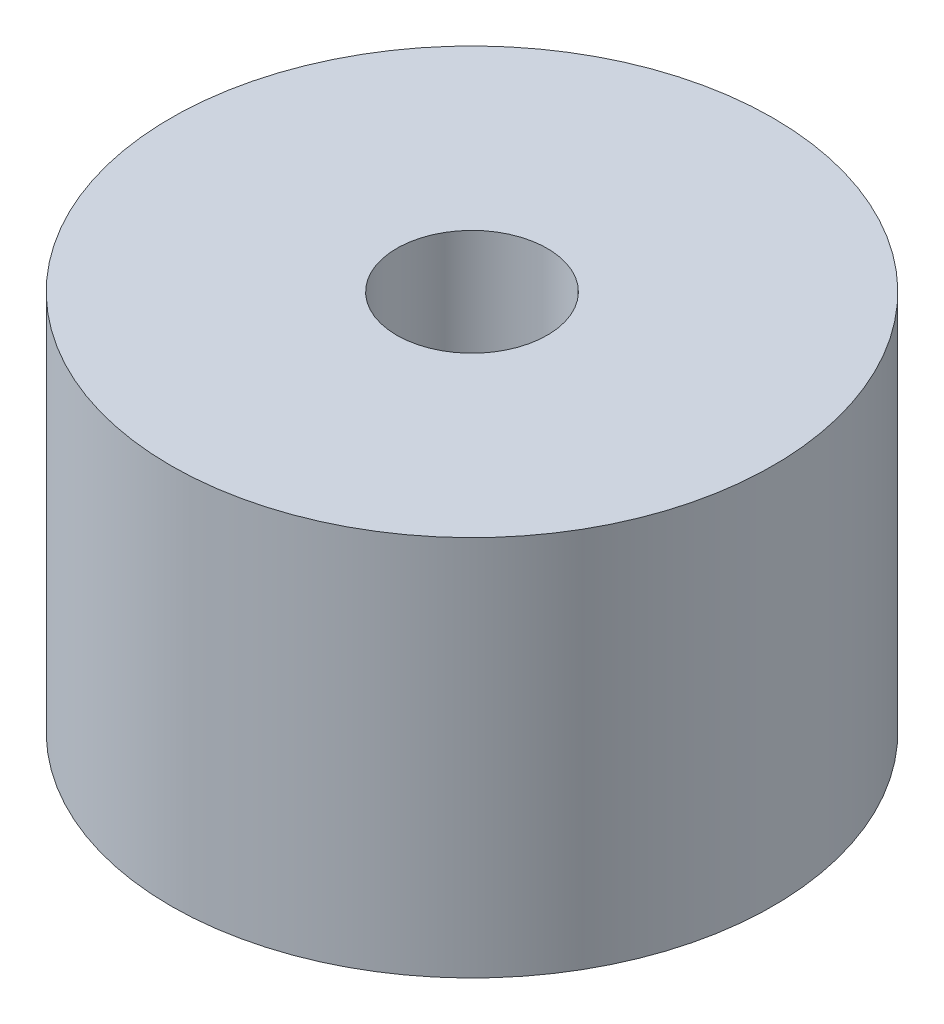
ISO-10303-21;
HEADER;
FILE_DESCRIPTION(('STEP AP214'),'2;1');
FILE_NAME('part.step','',(''),(''),'','','');
FILE_SCHEMA(('AUTOMOTIVE_DESIGN { 1 0 10303 214 1 1 1 1 }'));
ENDSEC;
DATA;
#1=APPLICATION_CONTEXT('core data for automotive mechanical design processes');
#2=APPLICATION_PROTOCOL_DEFINITION('international standard','automotive_design',2000,#1);
#3=PRODUCT_CONTEXT('',#1,'mechanical');
#4=PRODUCT('Part','Part','',(#3));
#5=PRODUCT_RELATED_PRODUCT_CATEGORY('part','',(#4));
#6=PRODUCT_DEFINITION_FORMATION('','',#4);
#7=PRODUCT_DEFINITION_CONTEXT('part definition',#1,'design');
#8=PRODUCT_DEFINITION('design','',#6,#7);
#9=PRODUCT_DEFINITION_SHAPE('','',#8);
#10=(LENGTH_UNIT() NAMED_UNIT(*) SI_UNIT(.MILLI.,.METRE.));
#11=(NAMED_UNIT(*) PLANE_ANGLE_UNIT() SI_UNIT($,.RADIAN.));
#12=(NAMED_UNIT(*) SI_UNIT($,.STERADIAN.) SOLID_ANGLE_UNIT());
#13=UNCERTAINTY_MEASURE_WITH_UNIT(LENGTH_MEASURE(1.E-05),#10,'distance_accuracy_value','');
#14=(GEOMETRIC_REPRESENTATION_CONTEXT(3) GLOBAL_UNCERTAINTY_ASSIGNED_CONTEXT((#13)) GLOBAL_UNIT_ASSIGNED_CONTEXT((#10,
#11,#12)) REPRESENTATION_CONTEXT('',''));
#15=CARTESIAN_POINT('',(0.,0.,0.));
#16=DIRECTION('',(0.,0.,1.));
#17=DIRECTION('',(1.,0.,0.));
#18=AXIS2_PLACEMENT_3D('',#15,#16,#17);
#19=CARTESIAN_POINT('',(0.,7.6,0.));
#20=DIRECTION('',(0.,-1.,0.));
#21=DIRECTION('',(0.,0.,-1.));
#22=AXIS2_PLACEMENT_3D('',#19,#20,#21);
#23=CYLINDRICAL_SURFACE('',#22,6.);
#24=CARTESIAN_POINT('',(0.,7.6,0.));
#25=DIRECTION('',(0.,1.,0.));
#26=DIRECTION('',(0.,0.,1.));
#27=AXIS2_PLACEMENT_3D('',#24,#25,#26);
#28=CIRCLE('',#27,6.);
#29=CARTESIAN_POINT('',(0.,7.6,6.));
#30=VERTEX_POINT('',#29);
#31=EDGE_CURVE('E10',#30,#30,#28,.T.);
#32=ORIENTED_EDGE('',*,*,#31,.F.);
#33=EDGE_LOOP('',(#32));
#34=FACE_BOUND('',#33,.T.);
#35=CARTESIAN_POINT('',(0.,0.,0.));
#36=DIRECTION('',(0.,1.,0.));
#37=DIRECTION('',(0.,0.,1.));
#38=AXIS2_PLACEMENT_3D('',#35,#36,#37);
#39=CIRCLE('',#38,6.);
#40=CARTESIAN_POINT('',(0.,0.,6.));
#41=VERTEX_POINT('',#40);
#42=EDGE_CURVE('E34',#41,#41,#39,.T.);
#43=ORIENTED_EDGE('',*,*,#42,.T.);
#44=EDGE_LOOP('',(#43));
#45=FACE_BOUND('',#44,.T.);
#46=ADVANCED_FACE('F31',(#34,#45),#23,.T.);
#47=CARTESIAN_POINT('',(0.,7.6,0.));
#48=DIRECTION('',(0.,1.,0.));
#49=DIRECTION('',(0.,0.,1.));
#50=AXIS2_PLACEMENT_3D('',#47,#48,#49);
#51=PLANE('',#50);
#52=CARTESIAN_POINT('',(0.,7.6,0.));
#53=DIRECTION('',(0.,1.,0.));
#54=DIRECTION('',(0.,0.,1.));
#55=AXIS2_PLACEMENT_3D('',#52,#53,#54);
#56=CIRCLE('',#55,1.5);
#57=CARTESIAN_POINT('',(0.,7.6,1.5));
#58=VERTEX_POINT('',#57);
#59=EDGE_CURVE('E43',#58,#58,#56,.T.);
#60=ORIENTED_EDGE('',*,*,#59,.F.);
#61=EDGE_LOOP('',(#60));
#62=FACE_BOUND('',#61,.T.);
#63=ORIENTED_EDGE('',*,*,#31,.T.);
#64=EDGE_LOOP('',(#63));
#65=FACE_BOUND('',#64,.T.);
#66=ADVANCED_FACE('F58',(#62,#65),#51,.T.);
#67=CARTESIAN_POINT('',(0.,0.,0.));
#68=DIRECTION('',(0.,1.,0.));
#69=DIRECTION('',(0.,0.,1.));
#70=AXIS2_PLACEMENT_3D('',#67,#68,#69);
#71=PLANE('',#70);
#72=ORIENTED_EDGE('',*,*,#42,.F.);
#73=EDGE_LOOP('',(#72));
#74=FACE_BOUND('',#73,.T.);
#75=ADVANCED_FACE('F54',(#74),#71,.F.);
#76=CARTESIAN_POINT('',(0.,3.6,0.));
#77=DIRECTION('',(0.,1.,0.));
#78=DIRECTION('',(0.,0.,1.));
#79=AXIS2_PLACEMENT_3D('',#76,#77,#78);
#80=CYLINDRICAL_SURFACE('',#79,1.5);
#81=CARTESIAN_POINT('',(0.,3.6,0.));
#82=DIRECTION('',(0.,1.,0.));
#83=DIRECTION('',(0.,0.,1.));
#84=AXIS2_PLACEMENT_3D('',#81,#82,#83);
#85=CIRCLE('',#84,1.5);
#86=CARTESIAN_POINT('',(0.,3.6,1.5));
#87=VERTEX_POINT('',#86);
#88=EDGE_CURVE('E41',#87,#87,#85,.T.);
#89=ORIENTED_EDGE('',*,*,#88,.F.);
#90=EDGE_LOOP('',(#89));
#91=FACE_BOUND('',#90,.T.);
#92=ORIENTED_EDGE('',*,*,#59,.T.);
#93=EDGE_LOOP('',(#92));
#94=FACE_BOUND('',#93,.T.);
#95=ADVANCED_FACE('F51',(#91,#94),#80,.F.);
#96=CARTESIAN_POINT('',(0.,3.6,0.));
#97=DIRECTION('',(0.,1.,0.));
#98=DIRECTION('',(0.,0.,1.));
#99=AXIS2_PLACEMENT_3D('',#96,#97,#98);
#100=PLANE('',#99);
#101=ORIENTED_EDGE('',*,*,#88,.T.);
#102=EDGE_LOOP('',(#101));
#103=FACE_BOUND('',#102,.T.);
#104=ADVANCED_FACE('F49',(#103),#100,.T.);
#105=CLOSED_SHELL('',(#46,#66,#75,#95,#104));
#106=MANIFOLD_SOLID_BREP('B2',#105);
#107=ADVANCED_BREP_SHAPE_REPRESENTATION('',(#18,#106),#14);
#108=SHAPE_DEFINITION_REPRESENTATION(#9,#107);
ENDSEC;
END-ISO-10303-21;
